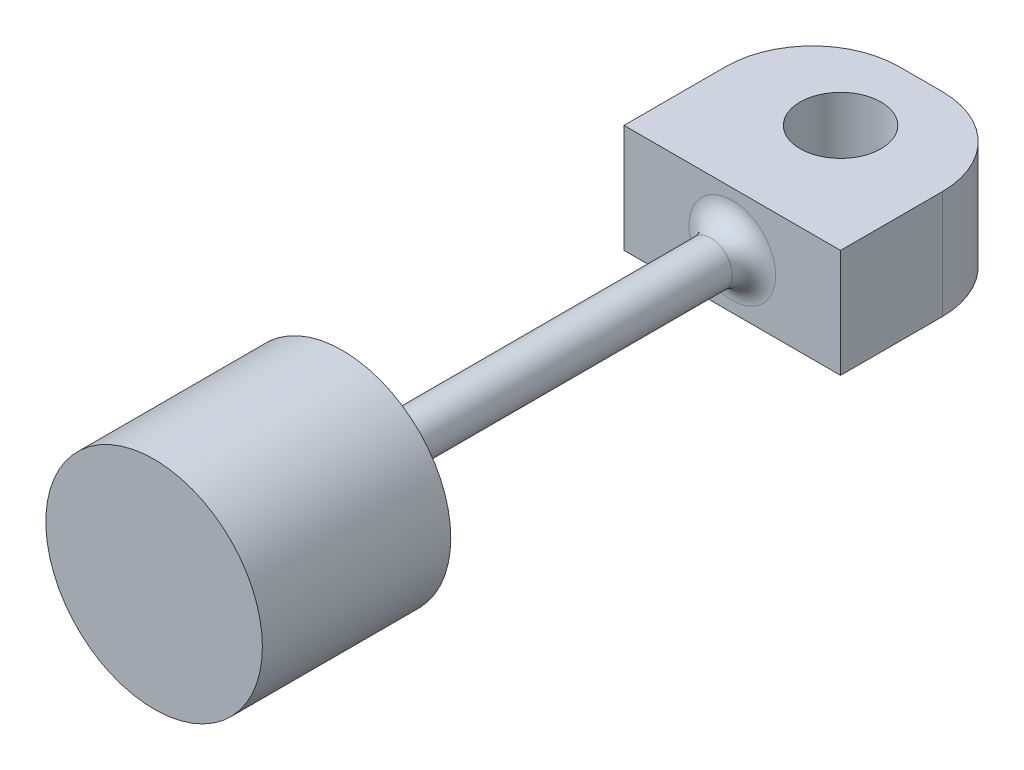
ISO-10303-21;
HEADER;
FILE_DESCRIPTION(('STEP AP214'),'2;1');
FILE_NAME('part.step','',(''),(''),'','','');
FILE_SCHEMA(('AUTOMOTIVE_DESIGN { 1 0 10303 214 1 1 1 1 }'));
ENDSEC;
DATA;
#1=APPLICATION_CONTEXT('core data for automotive mechanical design processes');
#2=APPLICATION_PROTOCOL_DEFINITION('international standard','automotive_design',2000,#1);
#3=PRODUCT_CONTEXT('',#1,'mechanical');
#4=PRODUCT('Part','Part','',(#3));
#5=PRODUCT_RELATED_PRODUCT_CATEGORY('part','',(#4));
#6=PRODUCT_DEFINITION_FORMATION('','',#4);
#7=PRODUCT_DEFINITION_CONTEXT('part definition',#1,'design');
#8=PRODUCT_DEFINITION('design','',#6,#7);
#9=PRODUCT_DEFINITION_SHAPE('','',#8);
#10=(LENGTH_UNIT() NAMED_UNIT(*) SI_UNIT(.MILLI.,.METRE.));
#11=(NAMED_UNIT(*) PLANE_ANGLE_UNIT() SI_UNIT($,.RADIAN.));
#12=(NAMED_UNIT(*) SI_UNIT($,.STERADIAN.) SOLID_ANGLE_UNIT());
#13=UNCERTAINTY_MEASURE_WITH_UNIT(LENGTH_MEASURE(1.E-05),#10,'distance_accuracy_value','');
#14=(GEOMETRIC_REPRESENTATION_CONTEXT(3) GLOBAL_UNCERTAINTY_ASSIGNED_CONTEXT((#13)) GLOBAL_UNIT_ASSIGNED_CONTEXT((#10,
#11,#12)) REPRESENTATION_CONTEXT('',''));
#15=CARTESIAN_POINT('',(0.,0.,0.));
#16=DIRECTION('',(0.,0.,1.));
#17=DIRECTION('',(1.,0.,0.));
#18=AXIS2_PLACEMENT_3D('',#15,#16,#17);
#19=CARTESIAN_POINT('',(0.,0.,-11.049));
#20=DIRECTION('',(0.,0.,1.));
#21=DIRECTION('',(1.,0.,0.));
#22=AXIS2_PLACEMENT_3D('',#19,#20,#21);
#23=CYLINDRICAL_SURFACE('',#22,6.35);
#24=CARTESIAN_POINT('',(0.,0.,-11.049));
#25=DIRECTION('',(0.,0.,1.));
#26=DIRECTION('',(1.,0.,0.));
#27=AXIS2_PLACEMENT_3D('',#24,#25,#26);
#28=CIRCLE('',#27,6.35);
#29=CARTESIAN_POINT('',(6.35,0.,-11.049));
#30=VERTEX_POINT('',#29);
#31=EDGE_CURVE('E144',#30,#30,#28,.T.);
#32=ORIENTED_EDGE('',*,*,#31,.T.);
#33=EDGE_LOOP('',(#32));
#34=FACE_BOUND('',#33,.T.);
#35=CARTESIAN_POINT('',(0.,0.,0.));
#36=DIRECTION('',(0.,0.,1.));
#37=DIRECTION('',(1.,0.,0.));
#38=AXIS2_PLACEMENT_3D('',#35,#36,#37);
#39=CIRCLE('',#38,6.35);
#40=CARTESIAN_POINT('',(6.35,0.,0.));
#41=VERTEX_POINT('',#40);
#42=EDGE_CURVE('E104',#41,#41,#39,.T.);
#43=ORIENTED_EDGE('',*,*,#42,.F.);
#44=EDGE_LOOP('',(#43));
#45=FACE_BOUND('',#44,.T.);
#46=ADVANCED_FACE('F43',(#34,#45),#23,.T.);
#47=CARTESIAN_POINT('',(0.,0.,-11.049));
#48=DIRECTION('',(0.,0.,1.));
#49=DIRECTION('',(1.,0.,0.));
#50=AXIS2_PLACEMENT_3D('',#47,#48,#49);
#51=PLANE('',#50);
#52=CARTESIAN_POINT('',(0.,0.,-11.049));
#53=DIRECTION('',(0.,0.,1.));
#54=DIRECTION('',(1.,0.,0.));
#55=AXIS2_PLACEMENT_3D('',#52,#53,#54);
#56=CIRCLE('',#55,2.54);
#57=CARTESIAN_POINT('',(2.54,0.,-11.049));
#58=VERTEX_POINT('',#57);
#59=EDGE_CURVE('E155',#58,#58,#56,.T.);
#60=ORIENTED_EDGE('',*,*,#59,.T.);
#61=EDGE_LOOP('',(#60));
#62=FACE_BOUND('',#61,.T.);
#63=ORIENTED_EDGE('',*,*,#31,.F.);
#64=EDGE_LOOP('',(#63));
#65=FACE_BOUND('',#64,.T.);
#66=ADVANCED_FACE('F211',(#62,#65),#51,.F.);
#67=CARTESIAN_POINT('',(0.,0.,0.));
#68=DIRECTION('',(0.,0.,1.));
#69=DIRECTION('',(1.,0.,0.));
#70=AXIS2_PLACEMENT_3D('',#67,#68,#69);
#71=PLANE('',#70);
#72=ORIENTED_EDGE('',*,*,#42,.T.);
#73=EDGE_LOOP('',(#72));
#74=FACE_BOUND('',#73,.T.);
#75=ADVANCED_FACE('F217',(#74),#71,.T.);
#76=CARTESIAN_POINT('',(0.,0.,-33.909));
#77=DIRECTION('',(0.,0.,1.));
#78=DIRECTION('',(1.,0.,0.));
#79=AXIS2_PLACEMENT_3D('',#76,#77,#78);
#80=CYLINDRICAL_SURFACE('',#79,1.27);
#81=CARTESIAN_POINT('',(0.,0.,-32.639));
#82=DIRECTION('',(0.,0.,-1.));
#83=DIRECTION('',(-1.,0.,0.));
#84=AXIS2_PLACEMENT_3D('',#81,#82,#83);
#85=CIRCLE('',#84,1.27);
#86=CARTESIAN_POINT('',(-1.27,0.,-32.639));
#87=VERTEX_POINT('',#86);
#88=EDGE_CURVE('E163',#87,#87,#85,.F.);
#89=ORIENTED_EDGE('',*,*,#88,.T.);
#90=EDGE_LOOP('',(#89));
#91=FACE_BOUND('',#90,.T.);
#92=CARTESIAN_POINT('',(0.,0.,-12.319));
#93=DIRECTION('',(0.,0.,1.));
#94=DIRECTION('',(1.,0.,0.));
#95=AXIS2_PLACEMENT_3D('',#92,#93,#94);
#96=CIRCLE('',#95,1.27);
#97=CARTESIAN_POINT('',(1.27,0.,-12.319));
#98=VERTEX_POINT('',#97);
#99=EDGE_CURVE('E148',#98,#98,#96,.F.);
#100=ORIENTED_EDGE('',*,*,#99,.T.);
#101=EDGE_LOOP('',(#100));
#102=FACE_BOUND('',#101,.T.);
#103=ADVANCED_FACE('F226',(#91,#102),#80,.T.);
#104=CARTESIAN_POINT('',(0.,0.,-12.319));
#105=DIRECTION('',(0.,0.,1.));
#106=DIRECTION('',(1.,0.,0.));
#107=AXIS2_PLACEMENT_3D('',#104,#105,#106);
#108=TOROIDAL_SURFACE('',#107,2.54,1.27);
#109=ORIENTED_EDGE('',*,*,#59,.F.);
#110=EDGE_LOOP('',(#109));
#111=FACE_BOUND('',#110,.T.);
#112=ORIENTED_EDGE('',*,*,#99,.F.);
#113=EDGE_LOOP('',(#112));
#114=FACE_BOUND('',#113,.T.);
#115=ADVANCED_FACE('F223',(#111,#114),#108,.F.);
#116=CARTESIAN_POINT('',(6.35,-3.175,-44.958));
#117=DIRECTION('',(-1.,0.,0.));
#118=DIRECTION('',(0.,0.,1.));
#119=AXIS2_PLACEMENT_3D('',#116,#117,#118);
#120=PLANE('',#119);
#121=DIRECTION('',(0.,0.,1.));
#122=VECTOR('',#121,1.);
#123=CARTESIAN_POINT('',(6.35,-3.175,-44.958));
#124=LINE('',#123,#122);
#125=CARTESIAN_POINT('',(6.35,-3.175,-39.878));
#126=VERTEX_POINT('',#125);
#127=CARTESIAN_POINT('',(6.35,-3.175,-33.909));
#128=VERTEX_POINT('',#127);
#129=EDGE_CURVE('E95',#126,#128,#124,.T.);
#130=ORIENTED_EDGE('',*,*,#129,.F.);
#131=DIRECTION('',(0.,-1.,0.));
#132=VECTOR('',#131,1.);
#133=CARTESIAN_POINT('',(6.35,3.175,-39.878));
#134=LINE('',#133,#132);
#135=CARTESIAN_POINT('',(6.35,3.175,-39.878));
#136=VERTEX_POINT('',#135);
#137=EDGE_CURVE('E11',#126,#136,#134,.F.);
#138=ORIENTED_EDGE('',*,*,#137,.T.);
#139=DIRECTION('',(0.,0.,1.));
#140=VECTOR('',#139,1.);
#141=CARTESIAN_POINT('',(6.35,3.175,-44.958));
#142=LINE('',#141,#140);
#143=CARTESIAN_POINT('',(6.35,3.175,-33.909));
#144=VERTEX_POINT('',#143);
#145=EDGE_CURVE('E118',#136,#144,#142,.T.);
#146=ORIENTED_EDGE('',*,*,#145,.T.);
#147=DIRECTION('',(0.,-1.,0.));
#148=VECTOR('',#147,1.);
#149=CARTESIAN_POINT('',(6.35,-3.175,-33.909));
#150=LINE('',#149,#148);
#151=EDGE_CURVE('E111',#144,#128,#150,.T.);
#152=ORIENTED_EDGE('',*,*,#151,.T.);
#153=EDGE_LOOP('',(#130,#138,#146,#152));
#154=FACE_BOUND('',#153,.T.);
#155=ADVANCED_FACE('F116',(#154),#120,.F.);
#156=CARTESIAN_POINT('',(-6.35,-3.175,-44.958));
#157=DIRECTION('',(0.,1.,0.));
#158=DIRECTION('',(-1.,0.,0.));
#159=AXIS2_PLACEMENT_3D('',#156,#157,#158);
#160=PLANE('',#159);
#161=CARTESIAN_POINT('',(0.,-3.175,-40.259));
#162=DIRECTION('',(0.,1.,0.));
#163=DIRECTION('',(-1.,0.,0.));
#164=AXIS2_PLACEMENT_3D('',#161,#162,#163);
#165=CIRCLE('',#164,2.3749);
#166=CARTESIAN_POINT('',(-2.3749,-3.175,-40.259));
#167=VERTEX_POINT('',#166);
#168=EDGE_CURVE('E121',#167,#167,#165,.T.);
#169=ORIENTED_EDGE('',*,*,#168,.T.);
#170=EDGE_LOOP('',(#169));
#171=FACE_BOUND('',#170,.T.);
#172=DIRECTION('',(0.,0.,1.));
#173=VECTOR('',#172,1.);
#174=CARTESIAN_POINT('',(-6.35,-3.175,-44.958));
#175=LINE('',#174,#173);
#176=CARTESIAN_POINT('',(-6.35,-3.175,-39.878));
#177=VERTEX_POINT('',#176);
#178=CARTESIAN_POINT('',(-6.35,-3.175,-33.909));
#179=VERTEX_POINT('',#178);
#180=EDGE_CURVE('E105',#177,#179,#175,.T.);
#181=ORIENTED_EDGE('',*,*,#180,.F.);
#182=CARTESIAN_POINT('',(-1.27,-3.175,-39.878));
#183=DIRECTION('',(0.,1.,0.));
#184=DIRECTION('',(-1.,0.,0.));
#185=AXIS2_PLACEMENT_3D('',#182,#183,#184);
#186=CIRCLE('',#185,5.08);
#187=CARTESIAN_POINT('',(-1.27,-3.175,-44.958));
#188=VERTEX_POINT('',#187);
#189=EDGE_CURVE('E52',#177,#188,#186,.F.);
#190=ORIENTED_EDGE('',*,*,#189,.T.);
#191=DIRECTION('',(-1.,0.,0.));
#192=VECTOR('',#191,1.);
#193=CARTESIAN_POINT('',(-6.35,-3.175,-44.958));
#194=LINE('',#193,#192);
#195=CARTESIAN_POINT('',(1.27,-3.175,-44.958));
#196=VERTEX_POINT('',#195);
#197=EDGE_CURVE('E136',#196,#188,#194,.T.);
#198=ORIENTED_EDGE('',*,*,#197,.F.);
#199=CARTESIAN_POINT('',(1.27,-3.175,-39.878));
#200=DIRECTION('',(0.,1.,0.));
#201=DIRECTION('',(-1.,0.,0.));
#202=AXIS2_PLACEMENT_3D('',#199,#200,#201);
#203=CIRCLE('',#202,5.08);
#204=EDGE_CURVE('E59',#196,#126,#203,.F.);
#205=ORIENTED_EDGE('',*,*,#204,.T.);
#206=ORIENTED_EDGE('',*,*,#129,.T.);
#207=DIRECTION('',(-1.,0.,0.));
#208=VECTOR('',#207,1.);
#209=CARTESIAN_POINT('',(-6.35,-3.175,-33.909));
#210=LINE('',#209,#208);
#211=EDGE_CURVE('E98',#128,#179,#210,.T.);
#212=ORIENTED_EDGE('',*,*,#211,.T.);
#213=EDGE_LOOP('',(#181,#190,#198,#205,#206,#212));
#214=FACE_BOUND('',#213,.T.);
#215=ADVANCED_FACE('F97',(#171,#214),#160,.F.);
#216=CARTESIAN_POINT('',(-6.35,-3.175,-44.958));
#217=DIRECTION('',(1.,0.,0.));
#218=DIRECTION('',(0.,0.,-1.));
#219=AXIS2_PLACEMENT_3D('',#216,#217,#218);
#220=PLANE('',#219);
#221=DIRECTION('',(0.,0.,1.));
#222=VECTOR('',#221,1.);
#223=CARTESIAN_POINT('',(-6.35,3.175,-44.958));
#224=LINE('',#223,#222);
#225=CARTESIAN_POINT('',(-6.35,3.175,-39.878));
#226=VERTEX_POINT('',#225);
#227=CARTESIAN_POINT('',(-6.35,3.175,-33.909));
#228=VERTEX_POINT('',#227);
#229=EDGE_CURVE('E139',#226,#228,#224,.T.);
#230=ORIENTED_EDGE('',*,*,#229,.F.);
#231=DIRECTION('',(0.,1.,0.));
#232=VECTOR('',#231,1.);
#233=CARTESIAN_POINT('',(-6.35,-3.175,-39.878));
#234=LINE('',#233,#232);
#235=EDGE_CURVE('E67',#226,#177,#234,.F.);
#236=ORIENTED_EDGE('',*,*,#235,.T.);
#237=ORIENTED_EDGE('',*,*,#180,.T.);
#238=DIRECTION('',(0.,1.,0.));
#239=VECTOR('',#238,1.);
#240=CARTESIAN_POINT('',(-6.35,-3.175,-33.909));
#241=LINE('',#240,#239);
#242=EDGE_CURVE('E113',#179,#228,#241,.T.);
#243=ORIENTED_EDGE('',*,*,#242,.T.);
#244=EDGE_LOOP('',(#230,#236,#237,#243));
#245=FACE_BOUND('',#244,.T.);
#246=ADVANCED_FACE('F198',(#245),#220,.F.);
#247=CARTESIAN_POINT('',(-6.35,3.175,-44.958));
#248=DIRECTION('',(0.,-1.,0.));
#249=DIRECTION('',(1.,0.,0.));
#250=AXIS2_PLACEMENT_3D('',#247,#248,#249);
#251=PLANE('',#250);
#252=CARTESIAN_POINT('',(0.,3.175,-40.259));
#253=DIRECTION('',(0.,1.,0.));
#254=DIRECTION('',(-1.,0.,0.));
#255=AXIS2_PLACEMENT_3D('',#252,#253,#254);
#256=CIRCLE('',#255,2.3749);
#257=CARTESIAN_POINT('',(-2.3749,3.175,-40.259));
#258=VERTEX_POINT('',#257);
#259=EDGE_CURVE('E125',#258,#258,#256,.T.);
#260=ORIENTED_EDGE('',*,*,#259,.F.);
#261=EDGE_LOOP('',(#260));
#262=FACE_BOUND('',#261,.T.);
#263=DIRECTION('',(1.,0.,0.));
#264=VECTOR('',#263,1.);
#265=CARTESIAN_POINT('',(-6.35,3.175,-44.958));
#266=LINE('',#265,#264);
#267=CARTESIAN_POINT('',(-1.27,3.175,-44.958));
#268=VERTEX_POINT('',#267);
#269=CARTESIAN_POINT('',(1.27,3.175,-44.958));
#270=VERTEX_POINT('',#269);
#271=EDGE_CURVE('E128',#268,#270,#266,.T.);
#272=ORIENTED_EDGE('',*,*,#271,.F.);
#273=CARTESIAN_POINT('',(-1.27,3.175,-39.878));
#274=DIRECTION('',(0.,-1.,0.));
#275=DIRECTION('',(1.,0.,0.));
#276=AXIS2_PLACEMENT_3D('',#273,#274,#275);
#277=CIRCLE('',#276,5.08);
#278=EDGE_CURVE('E178',#268,#226,#277,.F.);
#279=ORIENTED_EDGE('',*,*,#278,.T.);
#280=ORIENTED_EDGE('',*,*,#229,.T.);
#281=DIRECTION('',(1.,0.,0.));
#282=VECTOR('',#281,1.);
#283=CARTESIAN_POINT('',(-6.35,3.175,-33.909));
#284=LINE('',#283,#282);
#285=EDGE_CURVE('E133',#228,#144,#284,.T.);
#286=ORIENTED_EDGE('',*,*,#285,.T.);
#287=ORIENTED_EDGE('',*,*,#145,.F.);
#288=CARTESIAN_POINT('',(1.27,3.175,-39.878));
#289=DIRECTION('',(0.,-1.,0.));
#290=DIRECTION('',(1.,0.,0.));
#291=AXIS2_PLACEMENT_3D('',#288,#289,#290);
#292=CIRCLE('',#291,5.08);
#293=EDGE_CURVE('E175',#136,#270,#292,.F.);
#294=ORIENTED_EDGE('',*,*,#293,.T.);
#295=EDGE_LOOP('',(#272,#279,#280,#286,#287,#294));
#296=FACE_BOUND('',#295,.T.);
#297=ADVANCED_FACE('F197',(#262,#296),#251,.F.);
#298=CARTESIAN_POINT('',(0.,0.,-44.958));
#299=DIRECTION('',(0.,0.,-1.));
#300=DIRECTION('',(-1.,0.,0.));
#301=AXIS2_PLACEMENT_3D('',#298,#299,#300);
#302=PLANE('',#301);
#303=ORIENTED_EDGE('',*,*,#197,.T.);
#304=DIRECTION('',(0.,1.,0.));
#305=VECTOR('',#304,1.);
#306=CARTESIAN_POINT('',(-1.27,3.175,-44.958));
#307=LINE('',#306,#305);
#308=EDGE_CURVE('E171',#188,#268,#307,.T.);
#309=ORIENTED_EDGE('',*,*,#308,.T.);
#310=ORIENTED_EDGE('',*,*,#271,.T.);
#311=DIRECTION('',(0.,-1.,0.));
#312=VECTOR('',#311,1.);
#313=CARTESIAN_POINT('',(1.27,-3.175,-44.958));
#314=LINE('',#313,#312);
#315=EDGE_CURVE('E167',#270,#196,#314,.T.);
#316=ORIENTED_EDGE('',*,*,#315,.T.);
#317=EDGE_LOOP('',(#303,#309,#310,#316));
#318=FACE_BOUND('',#317,.T.);
#319=ADVANCED_FACE('F190',(#318),#302,.T.);
#320=CARTESIAN_POINT('',(0.,0.,-33.909));
#321=DIRECTION('',(0.,0.,-1.));
#322=DIRECTION('',(-1.,0.,0.));
#323=AXIS2_PLACEMENT_3D('',#320,#321,#322);
#324=PLANE('',#323);
#325=CARTESIAN_POINT('',(0.,0.,-33.909));
#326=DIRECTION('',(0.,0.,-1.));
#327=DIRECTION('',(-1.,0.,0.));
#328=AXIS2_PLACEMENT_3D('',#325,#326,#327);
#329=CIRCLE('',#328,2.54);
#330=CARTESIAN_POINT('',(-2.54,0.,-33.909));
#331=VERTEX_POINT('',#330);
#332=EDGE_CURVE('E159',#331,#331,#329,.T.);
#333=ORIENTED_EDGE('',*,*,#332,.T.);
#334=EDGE_LOOP('',(#333));
#335=FACE_BOUND('',#334,.T.);
#336=ORIENTED_EDGE('',*,*,#151,.F.);
#337=ORIENTED_EDGE('',*,*,#285,.F.);
#338=ORIENTED_EDGE('',*,*,#242,.F.);
#339=ORIENTED_EDGE('',*,*,#211,.F.);
#340=EDGE_LOOP('',(#336,#337,#338,#339));
#341=FACE_BOUND('',#340,.T.);
#342=ADVANCED_FACE('F109',(#335,#341),#324,.F.);
#343=CARTESIAN_POINT('',(0.,0.,-32.639));
#344=DIRECTION('',(0.,0.,-1.));
#345=DIRECTION('',(-1.,0.,0.));
#346=AXIS2_PLACEMENT_3D('',#343,#344,#345);
#347=TOROIDAL_SURFACE('',#346,2.54,1.27);
#348=ORIENTED_EDGE('',*,*,#88,.F.);
#349=EDGE_LOOP('',(#348));
#350=FACE_BOUND('',#349,.T.);
#351=ORIENTED_EDGE('',*,*,#332,.F.);
#352=EDGE_LOOP('',(#351));
#353=FACE_BOUND('',#352,.T.);
#354=ADVANCED_FACE('F209',(#350,#353),#347,.F.);
#355=CARTESIAN_POINT('',(-1.27,0.,-39.878));
#356=DIRECTION('',(0.,-1.,0.));
#357=DIRECTION('',(0.,0.,-1.));
#358=AXIS2_PLACEMENT_3D('',#355,#356,#357);
#359=CYLINDRICAL_SURFACE('',#358,5.08);
#360=ORIENTED_EDGE('',*,*,#189,.F.);
#361=ORIENTED_EDGE('',*,*,#235,.F.);
#362=ORIENTED_EDGE('',*,*,#278,.F.);
#363=ORIENTED_EDGE('',*,*,#308,.F.);
#364=EDGE_LOOP('',(#360,#361,#362,#363));
#365=FACE_BOUND('',#364,.T.);
#366=ADVANCED_FACE('F195',(#365),#359,.T.);
#367=CARTESIAN_POINT('',(1.27,0.,-39.878));
#368=DIRECTION('',(0.,1.,0.));
#369=DIRECTION('',(0.,0.,1.));
#370=AXIS2_PLACEMENT_3D('',#367,#368,#369);
#371=CYLINDRICAL_SURFACE('',#370,5.08);
#372=ORIENTED_EDGE('',*,*,#293,.F.);
#373=ORIENTED_EDGE('',*,*,#137,.F.);
#374=ORIENTED_EDGE('',*,*,#204,.F.);
#375=ORIENTED_EDGE('',*,*,#315,.F.);
#376=EDGE_LOOP('',(#372,#373,#374,#375));
#377=FACE_BOUND('',#376,.T.);
#378=ADVANCED_FACE('F45',(#377),#371,.T.);
#379=CARTESIAN_POINT('',(0.,-6.35,-40.259));
#380=DIRECTION('',(0.,1.,0.));
#381=DIRECTION('',(-1.,0.,0.));
#382=AXIS2_PLACEMENT_3D('',#379,#380,#381);
#383=CYLINDRICAL_SURFACE('',#382,2.3749);
#384=ORIENTED_EDGE('',*,*,#259,.T.);
#385=EDGE_LOOP('',(#384));
#386=FACE_BOUND('',#385,.T.);
#387=ORIENTED_EDGE('',*,*,#168,.F.);
#388=EDGE_LOOP('',(#387));
#389=FACE_BOUND('',#388,.T.);
#390=ADVANCED_FACE('F202',(#386,#389),#383,.F.);
#391=CLOSED_SHELL('',(#46,#66,#75,#103,#115,#155,#215,#246,#297,#319,#342,#354,#366,#378,#390));
#392=MANIFOLD_SOLID_BREP('B2',#391);
#393=ADVANCED_BREP_SHAPE_REPRESENTATION('',(#18,#392),#14);
#394=SHAPE_DEFINITION_REPRESENTATION(#9,#393);
ENDSEC;
END-ISO-10303-21;
